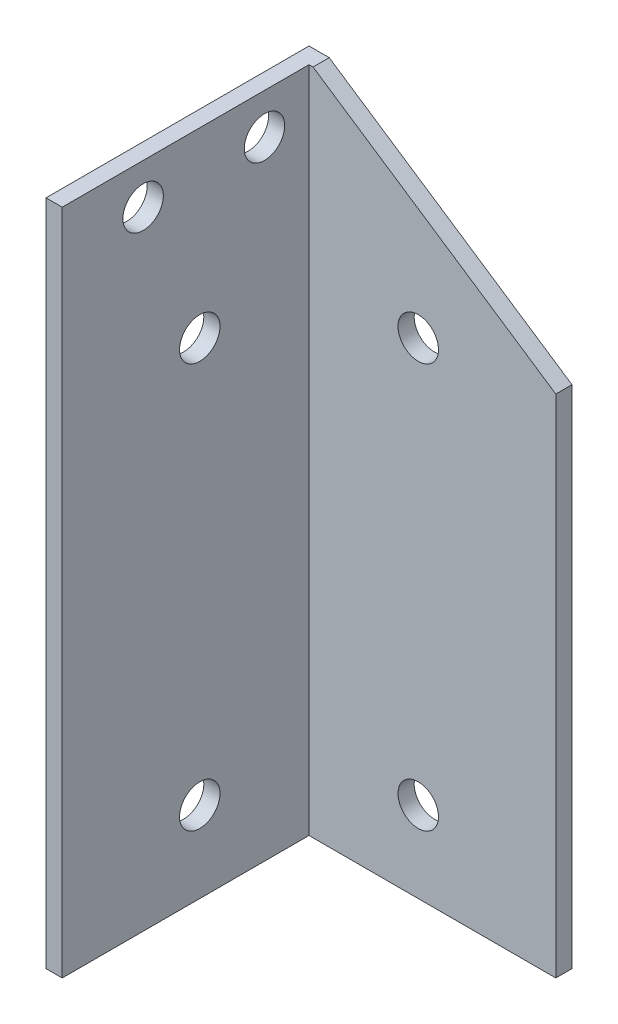
ISO-10303-21;
HEADER;
FILE_DESCRIPTION(('STEP AP214'),'2;1');
FILE_NAME('part.step','',(''),(''),'','','');
FILE_SCHEMA(('AUTOMOTIVE_DESIGN { 1 0 10303 214 1 1 1 1 }'));
ENDSEC;
DATA;
#1=APPLICATION_CONTEXT('core data for automotive mechanical design processes');
#2=APPLICATION_PROTOCOL_DEFINITION('international standard','automotive_design',2000,#1);
#3=PRODUCT_CONTEXT('',#1,'mechanical');
#4=PRODUCT('Part','Part','',(#3));
#5=PRODUCT_RELATED_PRODUCT_CATEGORY('part','',(#4));
#6=PRODUCT_DEFINITION_FORMATION('','',#4);
#7=PRODUCT_DEFINITION_CONTEXT('part definition',#1,'design');
#8=PRODUCT_DEFINITION('design','',#6,#7);
#9=PRODUCT_DEFINITION_SHAPE('','',#8);
#10=(LENGTH_UNIT() NAMED_UNIT(*) SI_UNIT(.MILLI.,.METRE.));
#11=(NAMED_UNIT(*) PLANE_ANGLE_UNIT() SI_UNIT($,.RADIAN.));
#12=(NAMED_UNIT(*) SI_UNIT($,.STERADIAN.) SOLID_ANGLE_UNIT());
#13=UNCERTAINTY_MEASURE_WITH_UNIT(LENGTH_MEASURE(1.E-05),#10,'distance_accuracy_value','');
#14=(GEOMETRIC_REPRESENTATION_CONTEXT(3) GLOBAL_UNCERTAINTY_ASSIGNED_CONTEXT((#13)) GLOBAL_UNIT_ASSIGNED_CONTEXT((#10,
#11,#12)) REPRESENTATION_CONTEXT('',''));
#15=CARTESIAN_POINT('',(0.,0.,0.));
#16=DIRECTION('',(0.,0.,1.));
#17=DIRECTION('',(1.,0.,0.));
#18=AXIS2_PLACEMENT_3D('',#15,#16,#17);
#19=CARTESIAN_POINT('',(4.,165.,0.));
#20=DIRECTION('',(-1.,0.,0.));
#21=DIRECTION('',(0.,0.,-1.));
#22=AXIS2_PLACEMENT_3D('',#19,#20,#21);
#23=PLANE('',#22);
#24=CARTESIAN_POINT('',(4.,20.,30.9999999999947));
#25=DIRECTION('',(1.,0.,0.));
#26=DIRECTION('',(0.,0.,-1.));
#27=AXIS2_PLACEMENT_3D('',#24,#25,#26);
#28=CIRCLE('',#27,4.99999999999998);
#29=CARTESIAN_POINT('',(4.,20.,25.9999999999947));
#30=VERTEX_POINT('',#29);
#31=EDGE_CURVE('E138',#30,#30,#28,.T.);
#32=ORIENTED_EDGE('',*,*,#31,.F.);
#33=EDGE_LOOP('',(#32));
#34=FACE_BOUND('',#33,.T.);
#35=CARTESIAN_POINT('',(4.,155.,15.));
#36=DIRECTION('',(1.,0.,0.));
#37=DIRECTION('',(0.,0.,-1.));
#38=AXIS2_PLACEMENT_3D('',#35,#36,#37);
#39=CIRCLE('',#38,5.);
#40=CARTESIAN_POINT('',(4.,155.,10.));
#41=VERTEX_POINT('',#40);
#42=EDGE_CURVE('E135',#41,#41,#39,.T.);
#43=ORIENTED_EDGE('',*,*,#42,.F.);
#44=EDGE_LOOP('',(#43));
#45=FACE_BOUND('',#44,.T.);
#46=CARTESIAN_POINT('',(4.,155.,45.));
#47=DIRECTION('',(1.,0.,0.));
#48=DIRECTION('',(0.,0.,-1.));
#49=AXIS2_PLACEMENT_3D('',#46,#47,#48);
#50=CIRCLE('',#49,5.00000000000001);
#51=CARTESIAN_POINT('',(4.,155.,40.));
#52=VERTEX_POINT('',#51);
#53=EDGE_CURVE('E127',#52,#52,#50,.T.);
#54=ORIENTED_EDGE('',*,*,#53,.F.);
#55=EDGE_LOOP('',(#54));
#56=FACE_BOUND('',#55,.T.);
#57=CARTESIAN_POINT('',(4.,120.,31.));
#58=DIRECTION('',(1.,0.,0.));
#59=DIRECTION('',(0.,0.,-1.));
#60=AXIS2_PLACEMENT_3D('',#57,#58,#59);
#61=CIRCLE('',#60,4.99999999999999);
#62=CARTESIAN_POINT('',(4.,120.,26.));
#63=VERTEX_POINT('',#62);
#64=EDGE_CURVE('E144',#63,#63,#61,.T.);
#65=ORIENTED_EDGE('',*,*,#64,.F.);
#66=EDGE_LOOP('',(#65));
#67=FACE_BOUND('',#66,.T.);
#68=DIRECTION('',(0.,0.,1.));
#69=VECTOR('',#68,1.);
#70=CARTESIAN_POINT('',(4.,0.,0.));
#71=LINE('',#70,#69);
#72=CARTESIAN_POINT('',(4.,0.,4.));
#73=VERTEX_POINT('',#72);
#74=CARTESIAN_POINT('',(4.,0.,65.));
#75=VERTEX_POINT('',#74);
#76=EDGE_CURVE('E162',#73,#75,#71,.T.);
#77=ORIENTED_EDGE('',*,*,#76,.F.);
#78=DIRECTION('',(0.,-1.,0.));
#79=VECTOR('',#78,1.);
#80=CARTESIAN_POINT('',(4.,165.,4.));
#81=LINE('',#80,#79);
#82=CARTESIAN_POINT('',(4.,165.,4.));
#83=VERTEX_POINT('',#82);
#84=EDGE_CURVE('E161',#83,#73,#81,.T.);
#85=ORIENTED_EDGE('',*,*,#84,.F.);
#86=DIRECTION('',(0.,0.,1.));
#87=VECTOR('',#86,1.);
#88=CARTESIAN_POINT('',(4.,165.,0.));
#89=LINE('',#88,#87);
#90=CARTESIAN_POINT('',(4.,165.,65.));
#91=VERTEX_POINT('',#90);
#92=EDGE_CURVE('E155',#83,#91,#89,.T.);
#93=ORIENTED_EDGE('',*,*,#92,.T.);
#94=DIRECTION('',(0.,-1.,0.));
#95=VECTOR('',#94,1.);
#96=CARTESIAN_POINT('',(4.,165.,65.));
#97=LINE('',#96,#95);
#98=EDGE_CURVE('E44',#91,#75,#97,.T.);
#99=ORIENTED_EDGE('',*,*,#98,.T.);
#100=EDGE_LOOP('',(#77,#85,#93,#99));
#101=FACE_BOUND('',#100,.T.);
#102=ADVANCED_FACE('F37',(#34,#45,#56,#67,#101),#23,.F.);
#103=CARTESIAN_POINT('',(0.,165.,65.));
#104=DIRECTION('',(0.,0.,1.));
#105=DIRECTION('',(-1.,0.,0.));
#106=AXIS2_PLACEMENT_3D('',#103,#104,#105);
#107=PLANE('',#106);
#108=DIRECTION('',(1.,0.,0.));
#109=VECTOR('',#108,1.);
#110=CARTESIAN_POINT('',(0.,0.,65.));
#111=LINE('',#110,#109);
#112=CARTESIAN_POINT('',(0.,0.,65.));
#113=VERTEX_POINT('',#112);
#114=EDGE_CURVE('E164',#113,#75,#111,.T.);
#115=ORIENTED_EDGE('',*,*,#114,.T.);
#116=ORIENTED_EDGE('',*,*,#98,.F.);
#117=DIRECTION('',(1.,0.,0.));
#118=VECTOR('',#117,1.);
#119=CARTESIAN_POINT('',(0.,165.,65.));
#120=LINE('',#119,#118);
#121=CARTESIAN_POINT('',(0.,165.,65.));
#122=VERTEX_POINT('',#121);
#123=EDGE_CURVE('E91',#122,#91,#120,.T.);
#124=ORIENTED_EDGE('',*,*,#123,.F.);
#125=DIRECTION('',(0.,-1.,0.));
#126=VECTOR('',#125,1.);
#127=CARTESIAN_POINT('',(0.,165.,65.));
#128=LINE('',#127,#126);
#129=EDGE_CURVE('E180',#122,#113,#128,.T.);
#130=ORIENTED_EDGE('',*,*,#129,.T.);
#131=EDGE_LOOP('',(#115,#116,#124,#130));
#132=FACE_BOUND('',#131,.T.);
#133=ADVANCED_FACE('F214',(#132),#107,.T.);
#134=CARTESIAN_POINT('',(0.,165.,0.));
#135=DIRECTION('',(-1.,0.,0.));
#136=DIRECTION('',(0.,0.,-1.));
#137=AXIS2_PLACEMENT_3D('',#134,#135,#136);
#138=PLANE('',#137);
#139=CARTESIAN_POINT('',(0.,20.,30.9999999999947));
#140=DIRECTION('',(1.,0.,0.));
#141=DIRECTION('',(0.,0.,-1.));
#142=AXIS2_PLACEMENT_3D('',#139,#140,#141);
#143=CIRCLE('',#142,4.99999999999998);
#144=CARTESIAN_POINT('',(0.,20.,25.9999999999947));
#145=VERTEX_POINT('',#144);
#146=EDGE_CURVE('E124',#145,#145,#143,.T.);
#147=ORIENTED_EDGE('',*,*,#146,.T.);
#148=EDGE_LOOP('',(#147));
#149=FACE_BOUND('',#148,.T.);
#150=CARTESIAN_POINT('',(0.,155.,15.));
#151=DIRECTION('',(1.,0.,0.));
#152=DIRECTION('',(0.,0.,-1.));
#153=AXIS2_PLACEMENT_3D('',#150,#151,#152);
#154=CIRCLE('',#153,5.);
#155=CARTESIAN_POINT('',(0.,155.,10.));
#156=VERTEX_POINT('',#155);
#157=EDGE_CURVE('E128',#156,#156,#154,.T.);
#158=ORIENTED_EDGE('',*,*,#157,.T.);
#159=EDGE_LOOP('',(#158));
#160=FACE_BOUND('',#159,.T.);
#161=CARTESIAN_POINT('',(0.,155.,45.));
#162=DIRECTION('',(1.,0.,0.));
#163=DIRECTION('',(0.,0.,-1.));
#164=AXIS2_PLACEMENT_3D('',#161,#162,#163);
#165=CIRCLE('',#164,5.00000000000001);
#166=CARTESIAN_POINT('',(0.,155.,40.));
#167=VERTEX_POINT('',#166);
#168=EDGE_CURVE('E123',#167,#167,#165,.T.);
#169=ORIENTED_EDGE('',*,*,#168,.T.);
#170=EDGE_LOOP('',(#169));
#171=FACE_BOUND('',#170,.T.);
#172=CARTESIAN_POINT('',(0.,120.,31.));
#173=DIRECTION('',(1.,0.,0.));
#174=DIRECTION('',(0.,0.,-1.));
#175=AXIS2_PLACEMENT_3D('',#172,#173,#174);
#176=CIRCLE('',#175,4.99999999999999);
#177=CARTESIAN_POINT('',(0.,120.,26.));
#178=VERTEX_POINT('',#177);
#179=EDGE_CURVE('E141',#178,#178,#176,.T.);
#180=ORIENTED_EDGE('',*,*,#179,.T.);
#181=EDGE_LOOP('',(#180));
#182=FACE_BOUND('',#181,.T.);
#183=DIRECTION('',(0.,0.,1.));
#184=VECTOR('',#183,1.);
#185=CARTESIAN_POINT('',(0.,0.,0.));
#186=LINE('',#185,#184);
#187=CARTESIAN_POINT('',(0.,0.,0.));
#188=VERTEX_POINT('',#187);
#189=EDGE_CURVE('E166',#188,#113,#186,.T.);
#190=ORIENTED_EDGE('',*,*,#189,.T.);
#191=ORIENTED_EDGE('',*,*,#129,.F.);
#192=DIRECTION('',(0.,0.,1.));
#193=VECTOR('',#192,1.);
#194=CARTESIAN_POINT('',(0.,165.,0.));
#195=LINE('',#194,#193);
#196=CARTESIAN_POINT('',(0.,165.,0.));
#197=VERTEX_POINT('',#196);
#198=EDGE_CURVE('E112',#197,#122,#195,.T.);
#199=ORIENTED_EDGE('',*,*,#198,.F.);
#200=DIRECTION('',(0.,-1.,0.));
#201=VECTOR('',#200,1.);
#202=CARTESIAN_POINT('',(0.,165.,0.));
#203=LINE('',#202,#201);
#204=EDGE_CURVE('E110',#197,#188,#203,.T.);
#205=ORIENTED_EDGE('',*,*,#204,.T.);
#206=EDGE_LOOP('',(#190,#191,#199,#205));
#207=FACE_BOUND('',#206,.T.);
#208=ADVANCED_FACE('F219',(#149,#160,#171,#182,#207),#138,.T.);
#209=CARTESIAN_POINT('',(0.,165.,0.));
#210=DIRECTION('',(0.,0.,-1.));
#211=DIRECTION('',(1.,0.,0.));
#212=AXIS2_PLACEMENT_3D('',#209,#210,#211);
#213=PLANE('',#212);
#214=DIRECTION('',(0.832050294337844,-0.554700196225229,0.));
#215=VECTOR('',#214,1.);
#216=CARTESIAN_POINT('',(5.00000000000001,165.,0.));
#217=LINE('',#216,#215);
#218=CARTESIAN_POINT('',(5.00000000000001,165.,0.));
#219=VERTEX_POINT('',#218);
#220=CARTESIAN_POINT('',(65.,125.,0.));
#221=VERTEX_POINT('',#220);
#222=EDGE_CURVE('E108',#219,#221,#217,.T.);
#223=ORIENTED_EDGE('',*,*,#222,.T.);
#224=DIRECTION('',(0.,-1.,0.));
#225=VECTOR('',#224,1.);
#226=CARTESIAN_POINT('',(65.,165.,0.));
#227=LINE('',#226,#225);
#228=CARTESIAN_POINT('',(65.,0.,0.));
#229=VERTEX_POINT('',#228);
#230=EDGE_CURVE('E177',#221,#229,#227,.T.);
#231=ORIENTED_EDGE('',*,*,#230,.T.);
#232=DIRECTION('',(-1.,0.,0.));
#233=VECTOR('',#232,1.);
#234=CARTESIAN_POINT('',(0.,0.,0.));
#235=LINE('',#234,#233);
#236=EDGE_CURVE('E168',#229,#188,#235,.T.);
#237=ORIENTED_EDGE('',*,*,#236,.T.);
#238=ORIENTED_EDGE('',*,*,#204,.F.);
#239=DIRECTION('',(-1.,0.,0.));
#240=VECTOR('',#239,1.);
#241=CARTESIAN_POINT('',(0.,165.,0.));
#242=LINE('',#241,#240);
#243=EDGE_CURVE('E101',#219,#197,#242,.T.);
#244=ORIENTED_EDGE('',*,*,#243,.F.);
#245=EDGE_LOOP('',(#223,#231,#237,#238,#244));
#246=FACE_BOUND('',#245,.T.);
#247=CARTESIAN_POINT('',(31.0000000000053,20.,0.));
#248=DIRECTION('',(0.,0.,1.));
#249=DIRECTION('',(1.,0.,0.));
#250=AXIS2_PLACEMENT_3D('',#247,#248,#249);
#251=CIRCLE('',#250,5.00000000000001);
#252=CARTESIAN_POINT('',(36.0000000000053,20.,0.));
#253=VERTEX_POINT('',#252);
#254=EDGE_CURVE('E147',#253,#253,#251,.T.);
#255=ORIENTED_EDGE('',*,*,#254,.T.);
#256=EDGE_LOOP('',(#255));
#257=FACE_BOUND('',#256,.T.);
#258=CARTESIAN_POINT('',(31.,120.,0.));
#259=DIRECTION('',(0.,0.,1.));
#260=DIRECTION('',(1.,0.,0.));
#261=AXIS2_PLACEMENT_3D('',#258,#259,#260);
#262=CIRCLE('',#261,4.99999999999999);
#263=CARTESIAN_POINT('',(36.,120.,0.));
#264=VERTEX_POINT('',#263);
#265=EDGE_CURVE('E151',#264,#264,#262,.T.);
#266=ORIENTED_EDGE('',*,*,#265,.T.);
#267=EDGE_LOOP('',(#266));
#268=FACE_BOUND('',#267,.T.);
#269=ADVANCED_FACE('F105',(#246,#257,#268),#213,.T.);
#270=CARTESIAN_POINT('',(65.,165.,4.));
#271=DIRECTION('',(1.,0.,0.));
#272=DIRECTION('',(0.,0.,1.));
#273=AXIS2_PLACEMENT_3D('',#270,#271,#272);
#274=PLANE('',#273);
#275=DIRECTION('',(0.,0.,-1.));
#276=VECTOR('',#275,1.);
#277=CARTESIAN_POINT('',(65.,125.,65.));
#278=LINE('',#277,#276);
#279=CARTESIAN_POINT('',(65.,125.,4.));
#280=VERTEX_POINT('',#279);
#281=EDGE_CURVE('E116',#280,#221,#278,.T.);
#282=ORIENTED_EDGE('',*,*,#281,.F.);
#283=DIRECTION('',(0.,-1.,0.));
#284=VECTOR('',#283,1.);
#285=CARTESIAN_POINT('',(65.,165.,4.));
#286=LINE('',#285,#284);
#287=CARTESIAN_POINT('',(65.,0.,4.));
#288=VERTEX_POINT('',#287);
#289=EDGE_CURVE('E174',#280,#288,#286,.T.);
#290=ORIENTED_EDGE('',*,*,#289,.T.);
#291=DIRECTION('',(0.,0.,-1.));
#292=VECTOR('',#291,1.);
#293=CARTESIAN_POINT('',(65.,0.,4.));
#294=LINE('',#293,#292);
#295=EDGE_CURVE('E170',#288,#229,#294,.T.);
#296=ORIENTED_EDGE('',*,*,#295,.T.);
#297=ORIENTED_EDGE('',*,*,#230,.F.);
#298=EDGE_LOOP('',(#282,#290,#296,#297));
#299=FACE_BOUND('',#298,.T.);
#300=ADVANCED_FACE('F194',(#299),#274,.T.);
#301=CARTESIAN_POINT('',(0.,165.,4.));
#302=DIRECTION('',(0.,0.,-1.));
#303=DIRECTION('',(1.,0.,0.));
#304=AXIS2_PLACEMENT_3D('',#301,#302,#303);
#305=PLANE('',#304);
#306=CARTESIAN_POINT('',(31.0000000000053,20.,4.));
#307=DIRECTION('',(0.,0.,1.));
#308=DIRECTION('',(1.,0.,0.));
#309=AXIS2_PLACEMENT_3D('',#306,#307,#308);
#310=CIRCLE('',#309,5.00000000000001);
#311=CARTESIAN_POINT('',(36.0000000000053,20.,4.));
#312=VERTEX_POINT('',#311);
#313=EDGE_CURVE('E150',#312,#312,#310,.T.);
#314=ORIENTED_EDGE('',*,*,#313,.F.);
#315=EDGE_LOOP('',(#314));
#316=FACE_BOUND('',#315,.T.);
#317=CARTESIAN_POINT('',(31.,120.,4.));
#318=DIRECTION('',(0.,0.,1.));
#319=DIRECTION('',(1.,0.,0.));
#320=AXIS2_PLACEMENT_3D('',#317,#318,#319);
#321=CIRCLE('',#320,4.99999999999999);
#322=CARTESIAN_POINT('',(36.,120.,4.));
#323=VERTEX_POINT('',#322);
#324=EDGE_CURVE('E154',#323,#323,#321,.T.);
#325=ORIENTED_EDGE('',*,*,#324,.F.);
#326=EDGE_LOOP('',(#325));
#327=FACE_BOUND('',#326,.T.);
#328=DIRECTION('',(1.,0.,0.));
#329=VECTOR('',#328,1.);
#330=CARTESIAN_POINT('',(0.,165.,4.));
#331=LINE('',#330,#329);
#332=CARTESIAN_POINT('',(5.00000000000001,165.,4.));
#333=VERTEX_POINT('',#332);
#334=EDGE_CURVE('E57',#333,#83,#331,.F.);
#335=ORIENTED_EDGE('',*,*,#334,.T.);
#336=ORIENTED_EDGE('',*,*,#84,.T.);
#337=DIRECTION('',(1.,0.,0.));
#338=VECTOR('',#337,1.);
#339=CARTESIAN_POINT('',(0.,0.,4.));
#340=LINE('',#339,#338);
#341=EDGE_CURVE('E85',#288,#73,#340,.F.);
#342=ORIENTED_EDGE('',*,*,#341,.F.);
#343=ORIENTED_EDGE('',*,*,#289,.F.);
#344=DIRECTION('',(0.832050294337844,-0.554700196225229,0.));
#345=VECTOR('',#344,1.);
#346=CARTESIAN_POINT('',(1.53846153846154,167.307692307692,4.));
#347=LINE('',#346,#345);
#348=EDGE_CURVE('E119',#333,#280,#347,.T.);
#349=ORIENTED_EDGE('',*,*,#348,.F.);
#350=EDGE_LOOP('',(#335,#336,#342,#343,#349));
#351=FACE_BOUND('',#350,.T.);
#352=ADVANCED_FACE('F191',(#316,#327,#351),#305,.F.);
#353=CARTESIAN_POINT('',(0.,165.,0.));
#354=DIRECTION('',(0.,-1.,0.));
#355=DIRECTION('',(-1.,0.,0.));
#356=AXIS2_PLACEMENT_3D('',#353,#354,#355);
#357=PLANE('',#356);
#358=ORIENTED_EDGE('',*,*,#243,.T.);
#359=ORIENTED_EDGE('',*,*,#198,.T.);
#360=ORIENTED_EDGE('',*,*,#123,.T.);
#361=ORIENTED_EDGE('',*,*,#92,.F.);
#362=ORIENTED_EDGE('',*,*,#334,.F.);
#363=DIRECTION('',(0.,0.,1.));
#364=VECTOR('',#363,1.);
#365=CARTESIAN_POINT('',(5.00000000000001,165.,0.));
#366=LINE('',#365,#364);
#367=EDGE_CURVE('E11',#219,#333,#366,.T.);
#368=ORIENTED_EDGE('',*,*,#367,.F.);
#369=EDGE_LOOP('',(#358,#359,#360,#361,#362,#368));
#370=FACE_BOUND('',#369,.T.);
#371=ADVANCED_FACE('F100',(#370),#357,.F.);
#372=CARTESIAN_POINT('',(0.,0.,0.));
#373=DIRECTION('',(0.,-1.,0.));
#374=DIRECTION('',(-1.,0.,0.));
#375=AXIS2_PLACEMENT_3D('',#372,#373,#374);
#376=PLANE('',#375);
#377=ORIENTED_EDGE('',*,*,#76,.T.);
#378=ORIENTED_EDGE('',*,*,#114,.F.);
#379=ORIENTED_EDGE('',*,*,#189,.F.);
#380=ORIENTED_EDGE('',*,*,#236,.F.);
#381=ORIENTED_EDGE('',*,*,#295,.F.);
#382=ORIENTED_EDGE('',*,*,#341,.T.);
#383=EDGE_LOOP('',(#377,#378,#379,#380,#381,#382));
#384=FACE_BOUND('',#383,.T.);
#385=ADVANCED_FACE('F200',(#384),#376,.T.);
#386=CARTESIAN_POINT('',(31.,120.,10.));
#387=DIRECTION('',(0.,0.,-1.));
#388=DIRECTION('',(1.,0.,0.));
#389=AXIS2_PLACEMENT_3D('',#386,#387,#388);
#390=CYLINDRICAL_SURFACE('',#389,4.99999999999999);
#391=ORIENTED_EDGE('',*,*,#265,.F.);
#392=EDGE_LOOP('',(#391));
#393=FACE_BOUND('',#392,.T.);
#394=ORIENTED_EDGE('',*,*,#324,.T.);
#395=EDGE_LOOP('',(#394));
#396=FACE_BOUND('',#395,.T.);
#397=ADVANCED_FACE('F198',(#393,#396),#390,.F.);
#398=CARTESIAN_POINT('',(31.0000000000053,20.,10.));
#399=DIRECTION('',(0.,0.,-1.));
#400=DIRECTION('',(1.,0.,0.));
#401=AXIS2_PLACEMENT_3D('',#398,#399,#400);
#402=CYLINDRICAL_SURFACE('',#401,5.00000000000001);
#403=ORIENTED_EDGE('',*,*,#254,.F.);
#404=EDGE_LOOP('',(#403));
#405=FACE_BOUND('',#404,.T.);
#406=ORIENTED_EDGE('',*,*,#313,.T.);
#407=EDGE_LOOP('',(#406));
#408=FACE_BOUND('',#407,.T.);
#409=ADVANCED_FACE('F189',(#405,#408),#402,.F.);
#410=CARTESIAN_POINT('',(10.,120.,31.));
#411=DIRECTION('',(-1.,0.,0.));
#412=DIRECTION('',(0.,0.,-1.));
#413=AXIS2_PLACEMENT_3D('',#410,#411,#412);
#414=CYLINDRICAL_SURFACE('',#413,4.99999999999999);
#415=ORIENTED_EDGE('',*,*,#179,.F.);
#416=EDGE_LOOP('',(#415));
#417=FACE_BOUND('',#416,.T.);
#418=ORIENTED_EDGE('',*,*,#64,.T.);
#419=EDGE_LOOP('',(#418));
#420=FACE_BOUND('',#419,.T.);
#421=ADVANCED_FACE('F207',(#417,#420),#414,.F.);
#422=CARTESIAN_POINT('',(10.,155.,45.));
#423=DIRECTION('',(-1.,0.,0.));
#424=DIRECTION('',(0.,0.,-1.));
#425=AXIS2_PLACEMENT_3D('',#422,#423,#424);
#426=CYLINDRICAL_SURFACE('',#425,5.00000000000001);
#427=ORIENTED_EDGE('',*,*,#168,.F.);
#428=EDGE_LOOP('',(#427));
#429=FACE_BOUND('',#428,.T.);
#430=ORIENTED_EDGE('',*,*,#53,.T.);
#431=EDGE_LOOP('',(#430));
#432=FACE_BOUND('',#431,.T.);
#433=ADVANCED_FACE('F275',(#429,#432),#426,.F.);
#434=CARTESIAN_POINT('',(10.,155.,15.));
#435=DIRECTION('',(-1.,0.,0.));
#436=DIRECTION('',(0.,0.,-1.));
#437=AXIS2_PLACEMENT_3D('',#434,#435,#436);
#438=CYLINDRICAL_SURFACE('',#437,5.);
#439=ORIENTED_EDGE('',*,*,#157,.F.);
#440=EDGE_LOOP('',(#439));
#441=FACE_BOUND('',#440,.T.);
#442=ORIENTED_EDGE('',*,*,#42,.T.);
#443=EDGE_LOOP('',(#442));
#444=FACE_BOUND('',#443,.T.);
#445=ADVANCED_FACE('F285',(#441,#444),#438,.F.);
#446=CARTESIAN_POINT('',(10.,20.,30.9999999999947));
#447=DIRECTION('',(-1.,0.,0.));
#448=DIRECTION('',(0.,0.,-1.));
#449=AXIS2_PLACEMENT_3D('',#446,#447,#448);
#450=CYLINDRICAL_SURFACE('',#449,4.99999999999998);
#451=ORIENTED_EDGE('',*,*,#146,.F.);
#452=EDGE_LOOP('',(#451));
#453=FACE_BOUND('',#452,.T.);
#454=ORIENTED_EDGE('',*,*,#31,.T.);
#455=EDGE_LOOP('',(#454));
#456=FACE_BOUND('',#455,.T.);
#457=ADVANCED_FACE('F295',(#453,#456),#450,.F.);
#458=CARTESIAN_POINT('',(5.00000000000001,165.,65.));
#459=DIRECTION('',(-0.554700196225229,-0.832050294337844,0.));
#460=DIRECTION('',(0.832050294337844,-0.554700196225229,0.));
#461=AXIS2_PLACEMENT_3D('',#458,#459,#460);
#462=PLANE('',#461);
#463=ORIENTED_EDGE('',*,*,#367,.T.);
#464=ORIENTED_EDGE('',*,*,#348,.T.);
#465=ORIENTED_EDGE('',*,*,#281,.T.);
#466=ORIENTED_EDGE('',*,*,#222,.F.);
#467=EDGE_LOOP('',(#463,#464,#465,#466));
#468=FACE_BOUND('',#467,.T.);
#469=ADVANCED_FACE('F114',(#468),#462,.F.);
#470=CLOSED_SHELL('',(#102,#133,#208,#269,#300,#352,#371,#385,#397,#409,#421,#433,#445,#457,#469));
#471=MANIFOLD_SOLID_BREP('B2',#470);
#472=ADVANCED_BREP_SHAPE_REPRESENTATION('',(#18,#471),#14);
#473=SHAPE_DEFINITION_REPRESENTATION(#9,#472);
ENDSEC;
END-ISO-10303-21;
